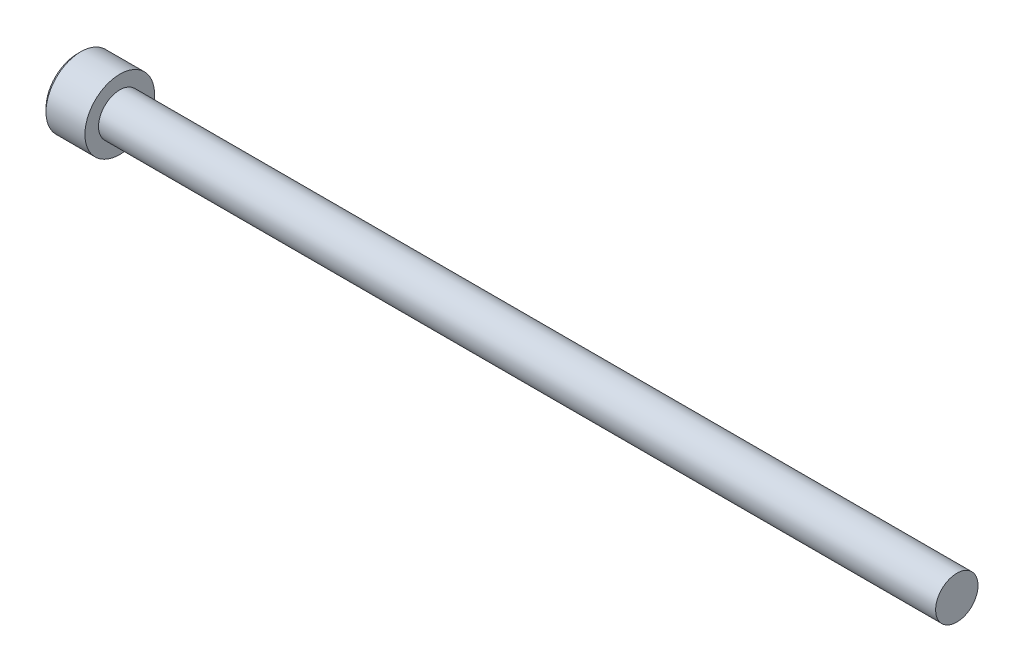
ISO-10303-21;
HEADER;
FILE_DESCRIPTION(('STEP AP214'),'2;1');
FILE_NAME('part.step','',(''),(''),'','','');
FILE_SCHEMA(('AUTOMOTIVE_DESIGN { 1 0 10303 214 1 1 1 1 }'));
ENDSEC;
DATA;
#1=APPLICATION_CONTEXT('core data for automotive mechanical design processes');
#2=APPLICATION_PROTOCOL_DEFINITION('international standard','automotive_design',2000,#1);
#3=PRODUCT_CONTEXT('',#1,'mechanical');
#4=PRODUCT('Part','Part','',(#3));
#5=PRODUCT_RELATED_PRODUCT_CATEGORY('part','',(#4));
#6=PRODUCT_DEFINITION_FORMATION('','',#4);
#7=PRODUCT_DEFINITION_CONTEXT('part definition',#1,'design');
#8=PRODUCT_DEFINITION('design','',#6,#7);
#9=PRODUCT_DEFINITION_SHAPE('','',#8);
#10=(LENGTH_UNIT() NAMED_UNIT(*) SI_UNIT(.MILLI.,.METRE.));
#11=(NAMED_UNIT(*) PLANE_ANGLE_UNIT() SI_UNIT($,.RADIAN.));
#12=(NAMED_UNIT(*) SI_UNIT($,.STERADIAN.) SOLID_ANGLE_UNIT());
#13=UNCERTAINTY_MEASURE_WITH_UNIT(LENGTH_MEASURE(1.E-05),#10,'distance_accuracy_value','');
#14=(GEOMETRIC_REPRESENTATION_CONTEXT(3) GLOBAL_UNCERTAINTY_ASSIGNED_CONTEXT((#13)) GLOBAL_UNIT_ASSIGNED_CONTEXT((#10,
#11,#12)) REPRESENTATION_CONTEXT('',''));
#15=CARTESIAN_POINT('',(0.,0.,0.));
#16=DIRECTION('',(0.,0.,1.));
#17=DIRECTION('',(1.,0.,0.));
#18=AXIS2_PLACEMENT_3D('',#15,#16,#17);
#19=CARTESIAN_POINT('',(-2.28600000000007,0.,0.));
#20=DIRECTION('',(-1.,0.,0.));
#21=DIRECTION('',(0.,0.,1.));
#22=AXIS2_PLACEMENT_3D('',#19,#20,#21);
#23=PLANE('',#22);
#24=DIRECTION('',(0.,0.5,0.866025403784439));
#25=VECTOR('',#24,1.);
#26=CARTESIAN_POINT('',(-2.28600000000007,2.29135888084633,0.));
#27=LINE('',#26,#25);
#28=CARTESIAN_POINT('',(-2.28600000000007,2.29135888084633,0.));
#29=VERTEX_POINT('',#28);
#30=CARTESIAN_POINT('',(-2.28600000000007,1.14567944042316,-1.984375));
#31=VERTEX_POINT('',#30);
#32=EDGE_CURVE('E72',#29,#31,#27,.F.);
#33=ORIENTED_EDGE('',*,*,#32,.T.);
#34=DIRECTION('',(0.,1.,0.));
#35=VECTOR('',#34,1.);
#36=CARTESIAN_POINT('',(-2.28600000000007,1.14567944042316,-1.984375));
#37=LINE('',#36,#35);
#38=CARTESIAN_POINT('',(-2.28600000000007,-1.14567944042316,-1.984375));
#39=VERTEX_POINT('',#38);
#40=EDGE_CURVE('E67',#31,#39,#37,.F.);
#41=ORIENTED_EDGE('',*,*,#40,.T.);
#42=DIRECTION('',(0.,0.5,-0.866025403784439));
#43=VECTOR('',#42,1.);
#44=CARTESIAN_POINT('',(-2.28600000000007,-1.14567944042316,-1.984375));
#45=LINE('',#44,#43);
#46=CARTESIAN_POINT('',(-2.28600000000007,-2.29135888084633,0.));
#47=VERTEX_POINT('',#46);
#48=EDGE_CURVE('E81',#39,#47,#45,.F.);
#49=ORIENTED_EDGE('',*,*,#48,.T.);
#50=DIRECTION('',(0.,-0.5,-0.866025403784439));
#51=VECTOR('',#50,1.);
#52=CARTESIAN_POINT('',(-2.28600000000007,-2.29135888084633,0.));
#53=LINE('',#52,#51);
#54=CARTESIAN_POINT('',(-2.28600000000007,-1.14567944042317,1.984375));
#55=VERTEX_POINT('',#54);
#56=EDGE_CURVE('E84',#47,#55,#53,.F.);
#57=ORIENTED_EDGE('',*,*,#56,.T.);
#58=DIRECTION('',(0.,1.,0.));
#59=VECTOR('',#58,1.);
#60=CARTESIAN_POINT('',(-2.28600000000007,-1.14567944042317,1.984375));
#61=LINE('',#60,#59);
#62=CARTESIAN_POINT('',(-2.28600000000007,1.14567944042317,1.984375));
#63=VERTEX_POINT('',#62);
#64=EDGE_CURVE('E94',#55,#63,#61,.T.);
#65=ORIENTED_EDGE('',*,*,#64,.T.);
#66=DIRECTION('',(0.,-0.5,0.866025403784439));
#67=VECTOR('',#66,1.);
#68=CARTESIAN_POINT('',(-2.28600000000007,1.14567944042316,1.984375));
#69=LINE('',#68,#67);
#70=EDGE_CURVE('E265',#63,#29,#69,.F.);
#71=ORIENTED_EDGE('',*,*,#70,.T.);
#72=EDGE_LOOP('',(#33,#41,#49,#57,#65,#71));
#73=FACE_BOUND('',#72,.T.);
#74=ADVANCED_FACE('F18',(#73),#23,.T.);
#75=CARTESIAN_POINT('',(-2.28600000000007,-1.14567944042316,-1.984375));
#76=DIRECTION('',(0.,-0.866025403784439,-0.5));
#77=DIRECTION('',(0.,0.5,-0.866025403784439));
#78=AXIS2_PLACEMENT_3D('',#75,#76,#77);
#79=PLANE('',#78);
#80=CARTESIAN_POINT('',(-4.82599999995871,-1.14567944040756,-1.98437500001887));
#81=CARTESIAN_POINT('',(-4.78666022792997,-1.18505700230148,-1.91617106214563));
#82=CARTESIAN_POINT('',(-4.74963132844072,-1.22509295783734,-1.8468267530301));
#83=CARTESIAN_POINT('',(-4.68183299424977,-1.30673037975396,-1.70542659047317));
#84=CARTESIAN_POINT('',(-4.65110127019237,-1.34833960561553,-1.63335729721673));
#85=CARTESIAN_POINT('',(-4.59845762010516,-1.432242568594,-1.48803310243203));
#86=CARTESIAN_POINT('',(-4.57641341195893,-1.47451494967301,-1.41481519064643));
#87=CARTESIAN_POINT('',(-4.54245011067441,-1.55999007976842,-1.26676792253773));
#88=CARTESIAN_POINT('',(-4.53050567471972,-1.6031902195197,-1.19194308559438));
#89=CARTESIAN_POINT('',(-4.51972842752365,-1.67764765054852,-1.06297903205139));
#90=CARTESIAN_POINT('',(-4.51813352794834,-1.70880881707173,-1.00900630841009));
#91=CARTESIAN_POINT('',(-4.52082392138599,-1.77108016542046,-0.901149169214274));
#92=CARTESIAN_POINT('',(-4.52511127545884,-1.80219032554946,-0.847264791239237));
#93=CARTESIAN_POINT('',(-4.53932219421538,-1.86411684097343,-0.740004920189235));
#94=CARTESIAN_POINT('',(-4.54925206045723,-1.8949328285454,-0.686630064029166));
#95=CARTESIAN_POINT('',(-4.5742029484467,-1.95603190279815,-0.580803363127978));
#96=CARTESIAN_POINT('',(-4.58922357974385,-1.98631503016081,-0.528351447923769));
#97=CARTESIAN_POINT('',(-4.63380478900425,-2.06386502548479,-0.394030915895904));
#98=CARTESIAN_POINT('',(-4.66672213384104,-2.11065153226583,-0.312994309042484));
#99=CARTESIAN_POINT('',(-4.72228952038986,-2.17944749410732,-0.193836207777459));
#100=CARTESIAN_POINT('',(-4.74181309375939,-2.20211890802843,-0.154568166986659));
#101=CARTESIAN_POINT('',(-4.78263970065987,-2.24704195201531,-0.0767591723707469));
#102=CARTESIAN_POINT('',(-4.80394164363173,-2.2692938292399,-0.0382177904539708));
#103=CARTESIAN_POINT('',(-4.82599999995675,-2.29135888085868,2.13931096265935E-11));
#104=B_SPLINE_CURVE_WITH_KNOTS('',3,(#80,#81,#82,#83,#84,#85,#86,#87,#88,#89,#90,#91,#92,#93,
#94,#95,#96,#97,#98,#99,#100,#101,#102,#103),.UNSPECIFIED.,.F.,.F.,(4,2,2,2,2,2,2,2,2,2,2,4),
(0.,0.264284909626495,0.530108996358094,0.791712695414128,1.05265800174404,1.23942150116703,
1.42625045663858,1.61328847394198,1.80031214908683,2.09727151182814,2.24534838946042,
2.39333511890876),.UNSPECIFIED.);
#105=CARTESIAN_POINT('',(-4.8259999999622,-1.14567944043207,-1.98437500001542));
#106=VERTEX_POINT('',#105);
#107=CARTESIAN_POINT('',(-4.82599999996846,-2.2913588808704,-2.00043543490866E-11));
#108=VERTEX_POINT('',#107);
#109=EDGE_CURVE('E21',#106,#108,#104,.T.);
#110=ORIENTED_EDGE('',*,*,#109,.T.);
#111=DIRECTION('',(1.,0.,0.));
#112=VECTOR('',#111,1.);
#113=CARTESIAN_POINT('',(-2.28600000000007,-2.29135888084633,0.));
#114=LINE('',#113,#112);
#115=EDGE_CURVE('E88',#108,#47,#114,.T.);
#116=ORIENTED_EDGE('',*,*,#115,.T.);
#117=ORIENTED_EDGE('',*,*,#48,.F.);
#118=DIRECTION('',(-1.,0.,0.));
#119=VECTOR('',#118,1.);
#120=CARTESIAN_POINT('',(-2.28600000000007,-1.14567944042316,-1.984375));
#121=LINE('',#120,#119);
#122=EDGE_CURVE('E59',#39,#106,#121,.T.);
#123=ORIENTED_EDGE('',*,*,#122,.T.);
#124=EDGE_LOOP('',(#110,#116,#117,#123));
#125=FACE_BOUND('',#124,.T.);
#126=ADVANCED_FACE('F89',(#125),#79,.F.);
#127=CARTESIAN_POINT('',(-2.28600000000007,-2.29135888084633,0.));
#128=DIRECTION('',(0.,-0.866025403784439,0.5));
#129=DIRECTION('',(0.,-0.5,-0.866025403784439));
#130=AXIS2_PLACEMENT_3D('',#127,#128,#129);
#131=PLANE('',#130);
#132=CARTESIAN_POINT('',(-4.8259999999587,-2.29135888085486,-2.29477011545215E-11));
#133=CARTESIAN_POINT('',(-4.78666022792997,-2.25198131896546,0.0682039378529055));
#134=CARTESIAN_POINT('',(-4.74963132844072,-2.21194536343147,0.137548246969503));
#135=CARTESIAN_POINT('',(-4.68183299424977,-2.13030794151622,0.278948409527231));
#136=CARTESIAN_POINT('',(-4.65110127019237,-2.08869871565414,0.351017702783381));
#137=CARTESIAN_POINT('',(-4.59845762010516,-2.00479575267531,0.49634189756787));
#138=CARTESIAN_POINT('',(-4.57641341195893,-1.96252337159644,0.569559809353542));
#139=CARTESIAN_POINT('',(-4.5424501106744,-1.87704824150112,0.717607077462301));
#140=CARTESIAN_POINT('',(-4.53050567471972,-1.8338481017498,0.792431914405622));
#141=CARTESIAN_POINT('',(-4.51972842752365,-1.75939067072096,0.921395967948603));
#142=CARTESIAN_POINT('',(-4.51813352794834,-1.72822950419776,0.975368691589913));
#143=CARTESIAN_POINT('',(-4.52082392138599,-1.66595815584903,1.08322583078573));
#144=CARTESIAN_POINT('',(-4.52511127545884,-1.63484799572003,1.13711020876076));
#145=CARTESIAN_POINT('',(-4.53932219421538,-1.57292148029607,1.24437007981077));
#146=CARTESIAN_POINT('',(-4.54925206045723,-1.54210549272409,1.29774493597083));
#147=CARTESIAN_POINT('',(-4.5742029484467,-1.48100641847134,1.40357163687202));
#148=CARTESIAN_POINT('',(-4.58922357974385,-1.45072329110868,1.45602355207623));
#149=CARTESIAN_POINT('',(-4.63380478900425,-1.3731732957847,1.5903440841041));
#150=CARTESIAN_POINT('',(-4.66672213384104,-1.32638678900366,1.67138069095752));
#151=CARTESIAN_POINT('',(-4.72228952038986,-1.25759082716218,1.79053879222254));
#152=CARTESIAN_POINT('',(-4.74181309375939,-1.23491941324106,1.82980683301334));
#153=CARTESIAN_POINT('',(-4.78263970065987,-1.18999636925419,1.90761582762925));
#154=CARTESIAN_POINT('',(-4.80394164363173,-1.1677444920296,1.94615720954603));
#155=CARTESIAN_POINT('',(-4.82599999995675,-1.14567944041081,1.98437500002139));
#156=B_SPLINE_CURVE_WITH_KNOTS('',3,(#132,#133,#134,#135,#136,#137,#138,#139,#140,#141,#142,
#143,#144,#145,#146,#147,#148,#149,#150,#151,#152,#153,#154,#155),.UNSPECIFIED.,.F.,.F.,(4,2,2,
2,2,2,2,2,2,2,2,4),(0.,0.264284909626495,0.530108996358093,0.791712695414127,1.05265800174404,
1.23942150116703,1.42625045663858,1.61328847394198,1.80031214908683,2.09727151182814,
2.24534838946042,2.39333511890876),.UNSPECIFIED.);
#157=CARTESIAN_POINT('',(-4.82599999996846,-1.14567944045252,1.98437500001084));
#158=VERTEX_POINT('',#157);
#159=EDGE_CURVE('E193',#108,#158,#156,.T.);
#160=ORIENTED_EDGE('',*,*,#159,.T.);
#161=DIRECTION('',(1.,0.,0.));
#162=VECTOR('',#161,1.);
#163=CARTESIAN_POINT('',(-2.28600000000007,-1.14567944042317,1.984375));
#164=LINE('',#163,#162);
#165=EDGE_CURVE('E98',#158,#55,#164,.T.);
#166=ORIENTED_EDGE('',*,*,#165,.T.);
#167=ORIENTED_EDGE('',*,*,#56,.F.);
#168=ORIENTED_EDGE('',*,*,#115,.F.);
#169=EDGE_LOOP('',(#160,#166,#167,#168));
#170=FACE_BOUND('',#169,.T.);
#171=ADVANCED_FACE('F96',(#170),#131,.F.);
#172=CARTESIAN_POINT('',(-2.28600000000007,-1.14567944042317,1.984375));
#173=DIRECTION('',(0.,0.,1.));
#174=DIRECTION('',(1.,0.,0.));
#175=AXIS2_PLACEMENT_3D('',#172,#173,#174);
#176=PLANE('',#175);
#177=ORIENTED_EDGE('',*,*,#165,.F.);
#178=CARTESIAN_POINT('',(-4.8259999999587,-1.14567944044731,1.98437499999592));
#179=CARTESIAN_POINT('',(-4.78691618362759,-1.06743880343337,1.98437499999852));
#180=CARTESIAN_POINT('',(-4.7501144768492,-0.987898318961585,1.9843749999996));
#181=CARTESIAN_POINT('',(-4.68265620500543,-0.825677042029378,1.9843750000004));
#182=CARTESIAN_POINT('',(-4.65204056061158,-0.742979382529768,1.98437500000011));
#183=CARTESIAN_POINT('',(-4.59917392283072,-0.575193959556404,1.98437499999988));
#184=CARTESIAN_POINT('',(-4.57689462080734,-0.49011535911761,1.98437499999994));
#185=CARTESIAN_POINT('',(-4.54259467221838,-0.318093091130319,1.98437500000006));
#186=CARTESIAN_POINT('',(-4.53054230228845,-0.231156054976752,1.98437500000012));
#187=CARTESIAN_POINT('',(-4.52249110263748,-0.119918521510987,1.98437499999997));
#188=CARTESIAN_POINT('',(-4.5211894755748,-0.095946844304627,1.98437499999992));
#189=CARTESIAN_POINT('',(-4.51945182629809,-0.0479845644411721,1.98437500000008));
#190=CARTESIAN_POINT('',(-4.51901533386212,-0.0239939791589256,1.98437500000028));
#191=CARTESIAN_POINT('',(-4.51901809008374,0.0602201717457216,1.98437500000061));
#192=CARTESIAN_POINT('',(-4.52177452299895,0.120461721905418,1.98437500000017));
#193=CARTESIAN_POINT('',(-4.53263655124937,0.240474970989155,1.98437499999983));
#194=CARTESIAN_POINT('',(-4.5407458774972,0.300246312758386,1.98437499999994));
#195=CARTESIAN_POINT('',(-4.57259622946933,0.478763752804253,1.98437500000012));
#196=CARTESIAN_POINT('',(-4.60385422611701,0.596208828937716,1.98437500000003));
#197=CARTESIAN_POINT('',(-4.66780003592242,0.785921487441385,1.98437499999998));
#198=CARTESIAN_POINT('',(-4.69623457768568,0.859734609867161,1.98437499999999));
#199=CARTESIAN_POINT('',(-4.75786140400834,1.00456595519332,1.98437500000001));
#200=CARTESIAN_POINT('',(-4.79100779300387,1.07560356657162,1.98437500000002));
#201=CARTESIAN_POINT('',(-4.82599999995679,1.14567944044795,1.984375));
#202=B_SPLINE_CURVE_WITH_KNOTS('',3,(#178,#179,#180,#181,#182,#183,#184,#185,#186,#187,#188,
#189,#190,#191,#192,#193,#194,#195,#196,#197,#198,#199,#200,#201),.UNSPECIFIED.,.F.,.F.,(4,2,2,
2,2,2,2,2,2,2,2,4),(0.,0.262559005207489,0.526801735838257,0.790138824405868,1.05265603861851,
1.12466619182165,1.19663719499109,1.37727026726594,1.55802937209457,1.92104085090406,
2.15819130092386,2.39317265078733),.UNSPECIFIED.);
#203=CARTESIAN_POINT('',(-4.82599999996846,1.14567944041787,1.98437500003084));
#204=VERTEX_POINT('',#203);
#205=EDGE_CURVE('E174',#158,#204,#202,.T.);
#206=ORIENTED_EDGE('',*,*,#205,.T.);
#207=DIRECTION('',(1.,0.,0.));
#208=VECTOR('',#207,1.);
#209=CARTESIAN_POINT('',(-2.28600000000007,1.14567944042316,1.984375));
#210=LINE('',#209,#208);
#211=EDGE_CURVE('E262',#204,#63,#210,.T.);
#212=ORIENTED_EDGE('',*,*,#211,.T.);
#213=ORIENTED_EDGE('',*,*,#64,.F.);
#214=EDGE_LOOP('',(#177,#206,#212,#213));
#215=FACE_BOUND('',#214,.T.);
#216=ADVANCED_FACE('F183',(#215),#176,.F.);
#217=CARTESIAN_POINT('',(-2.28600000000007,1.14567944042316,1.984375));
#218=DIRECTION('',(0.,0.866025403784439,0.5));
#219=DIRECTION('',(0.,-0.5,0.866025403784439));
#220=AXIS2_PLACEMENT_3D('',#217,#218,#219);
#221=PLANE('',#220);
#222=CARTESIAN_POINT('',(-4.8259999999587,1.14567944040756,1.98437500001887));
#223=CARTESIAN_POINT('',(-4.78666022792997,1.18505700230148,1.91617106214563));
#224=CARTESIAN_POINT('',(-4.74963132844072,1.22509295783734,1.8468267530301));
#225=CARTESIAN_POINT('',(-4.68183299424977,1.30673037975396,1.70542659047317));
#226=CARTESIAN_POINT('',(-4.65110127019237,1.34833960561553,1.63335729721672));
#227=CARTESIAN_POINT('',(-4.59845762010516,1.432242568594,1.48803310243203));
#228=CARTESIAN_POINT('',(-4.57641341195893,1.47451494967301,1.41481519064643));
#229=CARTESIAN_POINT('',(-4.5424501106744,1.55999007976842,1.26676792253773));
#230=CARTESIAN_POINT('',(-4.53050567471972,1.6031902195197,1.19194308559439));
#231=CARTESIAN_POINT('',(-4.51972842752365,1.67764765054852,1.06297903205139));
#232=CARTESIAN_POINT('',(-4.51813352794834,1.70880881707173,1.00900630841009));
#233=CARTESIAN_POINT('',(-4.52082392138599,1.77108016542046,0.901149169214275));
#234=CARTESIAN_POINT('',(-4.52511127545884,1.80219032554946,0.847264791239238));
#235=CARTESIAN_POINT('',(-4.53932219421538,1.86411684097342,0.740004920189235));
#236=CARTESIAN_POINT('',(-4.54925206045723,1.8949328285454,0.686630064029167));
#237=CARTESIAN_POINT('',(-4.5742029484467,1.95603190279815,0.580803363127978));
#238=CARTESIAN_POINT('',(-4.58922357974385,1.98631503016081,0.52835144792377));
#239=CARTESIAN_POINT('',(-4.63380478900425,2.06386502548479,0.394030915895905));
#240=CARTESIAN_POINT('',(-4.66672213384104,2.11065153226583,0.312994309042484));
#241=CARTESIAN_POINT('',(-4.72228952038986,2.17944749410732,0.19383620777746));
#242=CARTESIAN_POINT('',(-4.74181309375939,2.20211890802843,0.154568166986659));
#243=CARTESIAN_POINT('',(-4.78263970065987,2.2470419520153,0.0767591723707469));
#244=CARTESIAN_POINT('',(-4.80394164363173,2.2692938292399,0.0382177904539711));
#245=CARTESIAN_POINT('',(-4.82599999995675,2.29135888085868,-2.13927120621134E-11));
#246=B_SPLINE_CURVE_WITH_KNOTS('',3,(#222,#223,#224,#225,#226,#227,#228,#229,#230,#231,#232,
#233,#234,#235,#236,#237,#238,#239,#240,#241,#242,#243,#244,#245),.UNSPECIFIED.,.F.,.F.,(4,2,2,
2,2,2,2,2,2,2,2,4),(0.,0.264284909626494,0.530108996358092,0.791712695414125,1.05265800174404,
1.23942150116703,1.42625045663858,1.61328847394198,1.80031214908683,2.09727151182813,
2.24534838946042,2.39333511890876),.UNSPECIFIED.);
#247=CARTESIAN_POINT('',(-4.82599999996846,2.29135888087039,2.00042200943634E-11));
#248=VERTEX_POINT('',#247);
#249=EDGE_CURVE('E168',#204,#248,#246,.T.);
#250=ORIENTED_EDGE('',*,*,#249,.T.);
#251=DIRECTION('',(1.,0.,0.));
#252=VECTOR('',#251,1.);
#253=CARTESIAN_POINT('',(-2.28600000000007,2.29135888084633,0.));
#254=LINE('',#253,#252);
#255=EDGE_CURVE('E257',#248,#29,#254,.T.);
#256=ORIENTED_EDGE('',*,*,#255,.T.);
#257=ORIENTED_EDGE('',*,*,#70,.F.);
#258=ORIENTED_EDGE('',*,*,#211,.F.);
#259=EDGE_LOOP('',(#250,#256,#257,#258));
#260=FACE_BOUND('',#259,.T.);
#261=ADVANCED_FACE('F179',(#260),#221,.F.);
#262=CARTESIAN_POINT('',(-2.28600000000007,2.29135888084633,0.));
#263=DIRECTION('',(0.,0.866025403784439,-0.5));
#264=DIRECTION('',(0.,0.5,0.866025403784439));
#265=AXIS2_PLACEMENT_3D('',#262,#263,#264);
#266=PLANE('',#265);
#267=CARTESIAN_POINT('',(-4.82599999995871,2.29135888085486,2.29489280696874E-11));
#268=CARTESIAN_POINT('',(-4.78666022792997,2.25198131896547,-0.0682039378529039));
#269=CARTESIAN_POINT('',(-4.74963132844072,2.21194536343147,-0.137548246969502));
#270=CARTESIAN_POINT('',(-4.68183299424977,2.13030794151622,-0.278948409527229));
#271=CARTESIAN_POINT('',(-4.65110127019237,2.08869871565414,-0.351017702783379));
#272=CARTESIAN_POINT('',(-4.59845762010516,2.00479575267531,-0.496341897567869));
#273=CARTESIAN_POINT('',(-4.57641341195893,1.96252337159644,-0.569559809353541));
#274=CARTESIAN_POINT('',(-4.5424501106744,1.87704824150112,-0.7176070774623));
#275=CARTESIAN_POINT('',(-4.53050567471972,1.8338481017498,-0.792431914405622));
#276=CARTESIAN_POINT('',(-4.51972842752365,1.75939067072096,-0.921395967948603));
#277=CARTESIAN_POINT('',(-4.51813352794834,1.72822950419776,-0.975368691589912));
#278=CARTESIAN_POINT('',(-4.52082392138599,1.66595815584903,-1.08322583078573));
#279=CARTESIAN_POINT('',(-4.52511127545884,1.63484799572003,-1.13711020876076));
#280=CARTESIAN_POINT('',(-4.53932219421538,1.57292148029607,-1.24437007981077));
#281=CARTESIAN_POINT('',(-4.54925206045723,1.54210549272409,-1.29774493597083));
#282=CARTESIAN_POINT('',(-4.5742029484467,1.48100641847134,-1.40357163687202));
#283=CARTESIAN_POINT('',(-4.58922357974385,1.45072329110868,-1.45602355207623));
#284=CARTESIAN_POINT('',(-4.63380478900425,1.3731732957847,-1.5903440841041));
#285=CARTESIAN_POINT('',(-4.66672213384104,1.32638678900366,-1.67138069095752));
#286=CARTESIAN_POINT('',(-4.72228952038986,1.25759082716218,-1.79053879222254));
#287=CARTESIAN_POINT('',(-4.74181309375939,1.23491941324106,-1.82980683301334));
#288=CARTESIAN_POINT('',(-4.78263970065987,1.18999636925419,-1.90761582762925));
#289=CARTESIAN_POINT('',(-4.80394164363173,1.1677444920296,-1.94615720954603));
#290=CARTESIAN_POINT('',(-4.82599999995675,1.14567944041081,-1.98437500002139));
#291=B_SPLINE_CURVE_WITH_KNOTS('',3,(#267,#268,#269,#270,#271,#272,#273,#274,#275,#276,#277,
#278,#279,#280,#281,#282,#283,#284,#285,#286,#287,#288,#289,#290),.UNSPECIFIED.,.F.,.F.,(4,2,2,
2,2,2,2,2,2,2,2,4),(0.,0.264284909626495,0.530108996358093,0.791712695414127,1.05265800174404,
1.23942150116703,1.42625045663858,1.61328847394198,1.80031214908683,2.09727151182814,
2.24534838946042,2.39333511890876),.UNSPECIFIED.);
#292=CARTESIAN_POINT('',(-4.82599999996846,1.14567944045252,-1.98437500001084));
#293=VERTEX_POINT('',#292);
#294=EDGE_CURVE('E40',#248,#293,#291,.T.);
#295=ORIENTED_EDGE('',*,*,#294,.T.);
#296=DIRECTION('',(-1.,0.,0.));
#297=VECTOR('',#296,1.);
#298=CARTESIAN_POINT('',(-2.28600000000007,1.14567944042316,-1.984375));
#299=LINE('',#298,#297);
#300=EDGE_CURVE('E247',#293,#31,#299,.F.);
#301=ORIENTED_EDGE('',*,*,#300,.T.);
#302=ORIENTED_EDGE('',*,*,#32,.F.);
#303=ORIENTED_EDGE('',*,*,#255,.F.);
#304=EDGE_LOOP('',(#295,#301,#302,#303));
#305=FACE_BOUND('',#304,.T.);
#306=ADVANCED_FACE('F182',(#305),#266,.F.);
#307=CARTESIAN_POINT('',(-2.28600000000007,1.14567944042316,-1.984375));
#308=DIRECTION('',(0.,0.,-1.));
#309=DIRECTION('',(-1.,0.,0.));
#310=AXIS2_PLACEMENT_3D('',#307,#308,#309);
#311=PLANE('',#310);
#312=CARTESIAN_POINT('',(-4.8259999999587,1.14567944044731,-1.98437499999592));
#313=CARTESIAN_POINT('',(-4.78666022793094,1.06692431665146,-1.98437499999853));
#314=CARTESIAN_POINT('',(-4.74963132844318,0.986852405569011,-1.98437499999961));
#315=CARTESIAN_POINT('',(-4.6818329942566,0.823577561711963,-1.9843750000004));
#316=CARTESIAN_POINT('',(-4.65110127020207,0.740359109975722,-1.98437500000011));
#317=CARTESIAN_POINT('',(-4.59845762012233,0.572553183993917,-1.9843749999999));
#318=CARTESIAN_POINT('',(-4.57641341198063,0.488008421824127,-1.98437499999997));
#319=CARTESIAN_POINT('',(-4.54245011070673,0.317058161610178,-1.98437500000003));
#320=CARTESIAN_POINT('',(-4.53050567475816,0.230657882096267,-1.98437500000001));
#321=CARTESIAN_POINT('',(-4.51972842757294,0.0817430200124032,-1.984375));
#322=CARTESIAN_POINT('',(-4.51813352800283,0.0194206869508218,-1.984375));
#323=CARTESIAN_POINT('',(-4.52082392145254,-0.1051220097764,-1.984375));
#324=CARTESIAN_POINT('',(-4.52511127553227,-0.167342330049008,-1.984375));
#325=CARTESIAN_POINT('',(-4.53932219430377,-0.291195360925477,-1.984375));
#326=CARTESIAN_POINT('',(-4.54925206055372,-0.352827336083362,-1.984375));
#327=CARTESIAN_POINT('',(-4.57420294856008,-0.475025484616114,-1.984375));
#328=CARTESIAN_POINT('',(-4.58922357986604,-0.535591739354747,-1.984375));
#329=CARTESIAN_POINT('',(-4.63380478912724,-0.690691729958653,-1.984375));
#330=CARTESIAN_POINT('',(-4.66672213394715,-0.784264743465576,-1.984375));
#331=CARTESIAN_POINT('',(-4.7222895204619,-0.921856667069616,-1.984375));
#332=CARTESIAN_POINT('',(-4.74181309381856,-0.967199494886089,-1.984375));
#333=CARTESIAN_POINT('',(-4.78263970069104,-1.05704558280959,-1.984375));
#334=CARTESIAN_POINT('',(-4.80394164364776,-1.10154933723428,-1.984375));
#335=CARTESIAN_POINT('',(-4.82599999995675,-1.14567944044787,-1.984375));
#336=B_SPLINE_CURVE_WITH_KNOTS('',3,(#312,#313,#314,#315,#316,#317,#318,#319,#320,#321,#322,
#323,#324,#325,#326,#327,#328,#329,#330,#331,#332,#333,#334,#335),.UNSPECIFIED.,.F.,.F.,(4,2,2,
2,2,2,2,2,2,2,2,4),(0.,0.264284909658836,0.530108996422784,0.791712695509868,1.0526580018708,
1.23942150133878,1.42625045685537,1.61328847420389,1.80031214939384,2.09727151196384,
2.24534838950992,2.39333511887245),.UNSPECIFIED.);
#337=EDGE_CURVE('E133',#293,#106,#336,.T.);
#338=ORIENTED_EDGE('',*,*,#337,.T.);
#339=ORIENTED_EDGE('',*,*,#122,.F.);
#340=ORIENTED_EDGE('',*,*,#40,.F.);
#341=ORIENTED_EDGE('',*,*,#300,.F.);
#342=EDGE_LOOP('',(#338,#339,#340,#341));
#343=FACE_BOUND('',#342,.T.);
#344=ADVANCED_FACE('F146',(#343),#311,.F.);
#345=CARTESIAN_POINT('',(-4.82599999998001,0.,0.));
#346=DIRECTION('',(-1.,0.,0.));
#347=DIRECTION('',(0.,0.,1.));
#348=AXIS2_PLACEMENT_3D('',#345,#346,#347);
#349=CONICAL_SURFACE('',#348,2.29135888088194,0.785398163397448);
#350=ORIENTED_EDGE('',*,*,#109,.F.);
#351=CARTESIAN_POINT('',(-4.82599999998001,0.,0.));
#352=DIRECTION('',(-1.,0.,0.));
#353=DIRECTION('',(0.,0.,1.));
#354=AXIS2_PLACEMENT_3D('',#351,#352,#353);
#355=CIRCLE('',#354,2.29135888088194);
#356=EDGE_CURVE('E131',#106,#108,#355,.T.);
#357=ORIENTED_EDGE('',*,*,#356,.T.);
#358=EDGE_LOOP('',(#350,#357));
#359=FACE_BOUND('',#358,.T.);
#360=ADVANCED_FACE('F200',(#359),#349,.F.);
#361=CARTESIAN_POINT('',(-4.82599999998001,0.,0.));
#362=DIRECTION('',(-1.,0.,0.));
#363=DIRECTION('',(0.,0.,1.));
#364=AXIS2_PLACEMENT_3D('',#361,#362,#363);
#365=CONICAL_SURFACE('',#364,2.29135888088194,0.785398163397448);
#366=ORIENTED_EDGE('',*,*,#159,.F.);
#367=CARTESIAN_POINT('',(-4.82599999998001,0.,0.));
#368=DIRECTION('',(-1.,0.,0.));
#369=DIRECTION('',(0.,0.,1.));
#370=AXIS2_PLACEMENT_3D('',#367,#368,#369);
#371=CIRCLE('',#370,2.29135888088194);
#372=EDGE_CURVE('E128',#108,#158,#371,.T.);
#373=ORIENTED_EDGE('',*,*,#372,.T.);
#374=EDGE_LOOP('',(#366,#373));
#375=FACE_BOUND('',#374,.T.);
#376=ADVANCED_FACE('F197',(#375),#365,.F.);
#377=CARTESIAN_POINT('',(-4.82599999998001,0.,0.));
#378=DIRECTION('',(-1.,0.,0.));
#379=DIRECTION('',(0.,0.,1.));
#380=AXIS2_PLACEMENT_3D('',#377,#378,#379);
#381=CONICAL_SURFACE('',#380,2.29135888088194,0.78539816348948);
#382=ORIENTED_EDGE('',*,*,#205,.F.);
#383=CARTESIAN_POINT('',(-4.82599999998001,0.,0.));
#384=DIRECTION('',(-1.,0.,0.));
#385=DIRECTION('',(0.,0.,1.));
#386=AXIS2_PLACEMENT_3D('',#383,#384,#385);
#387=CIRCLE('',#386,2.29135888088194);
#388=EDGE_CURVE('E125',#158,#204,#387,.T.);
#389=ORIENTED_EDGE('',*,*,#388,.T.);
#390=EDGE_LOOP('',(#382,#389));
#391=FACE_BOUND('',#390,.T.);
#392=ADVANCED_FACE('F164',(#391),#381,.F.);
#393=CARTESIAN_POINT('',(-4.82599999998001,0.,0.));
#394=DIRECTION('',(-1.,0.,0.));
#395=DIRECTION('',(0.,0.,1.));
#396=AXIS2_PLACEMENT_3D('',#393,#394,#395);
#397=CONICAL_SURFACE('',#396,2.29135888088194,0.785398163397448);
#398=ORIENTED_EDGE('',*,*,#249,.F.);
#399=CARTESIAN_POINT('',(-4.82599999998001,0.,0.));
#400=DIRECTION('',(-1.,0.,0.));
#401=DIRECTION('',(0.,0.,1.));
#402=AXIS2_PLACEMENT_3D('',#399,#400,#401);
#403=CIRCLE('',#402,2.29135888088194);
#404=EDGE_CURVE('E122',#204,#248,#403,.T.);
#405=ORIENTED_EDGE('',*,*,#404,.T.);
#406=EDGE_LOOP('',(#398,#405));
#407=FACE_BOUND('',#406,.T.);
#408=ADVANCED_FACE('F159',(#407),#397,.F.);
#409=CARTESIAN_POINT('',(-4.82599999998001,0.,0.));
#410=DIRECTION('',(-1.,0.,0.));
#411=DIRECTION('',(0.,0.,1.));
#412=AXIS2_PLACEMENT_3D('',#409,#410,#411);
#413=CONICAL_SURFACE('',#412,2.29135888088194,0.785398163397448);
#414=ORIENTED_EDGE('',*,*,#294,.F.);
#415=CARTESIAN_POINT('',(-4.82599999998001,0.,0.));
#416=DIRECTION('',(-1.,0.,0.));
#417=DIRECTION('',(0.,0.,1.));
#418=AXIS2_PLACEMENT_3D('',#415,#416,#417);
#419=CIRCLE('',#418,2.29135888088194);
#420=EDGE_CURVE('E119',#248,#293,#419,.T.);
#421=ORIENTED_EDGE('',*,*,#420,.T.);
#422=EDGE_LOOP('',(#414,#421));
#423=FACE_BOUND('',#422,.T.);
#424=ADVANCED_FACE('F153',(#423),#413,.F.);
#425=CARTESIAN_POINT('',(-4.82599999998001,0.,0.));
#426=DIRECTION('',(-1.,0.,0.));
#427=DIRECTION('',(0.,0.,1.));
#428=AXIS2_PLACEMENT_3D('',#425,#426,#427);
#429=CONICAL_SURFACE('',#428,2.29135888088194,0.785398163489476);
#430=ORIENTED_EDGE('',*,*,#337,.F.);
#431=CARTESIAN_POINT('',(-4.82599999998001,0.,0.));
#432=DIRECTION('',(-1.,0.,0.));
#433=DIRECTION('',(0.,0.,1.));
#434=AXIS2_PLACEMENT_3D('',#431,#432,#433);
#435=CIRCLE('',#434,2.29135888088194);
#436=EDGE_CURVE('E116',#293,#106,#435,.T.);
#437=ORIENTED_EDGE('',*,*,#436,.T.);
#438=EDGE_LOOP('',(#430,#437));
#439=FACE_BOUND('',#438,.T.);
#440=ADVANCED_FACE('F148',(#439),#429,.F.);
#441=CARTESIAN_POINT('',(-4.82600000000007,0.,0.));
#442=DIRECTION('',(1.,0.,0.));
#443=DIRECTION('',(0.,0.,-1.));
#444=AXIS2_PLACEMENT_3D('',#441,#442,#443);
#445=PLANE('',#444);
#446=CARTESIAN_POINT('',(-4.82599999998001,0.,0.));
#447=DIRECTION('',(1.,0.,0.));
#448=DIRECTION('',(0.,0.,-1.));
#449=AXIS2_PLACEMENT_3D('',#446,#447,#448);
#450=CIRCLE('',#449,3.56615999999121);
#451=CARTESIAN_POINT('',(-4.82599999998001,0.,-3.56615999999121));
#452=VERTEX_POINT('',#451);
#453=EDGE_CURVE('E113',#452,#452,#450,.T.);
#454=ORIENTED_EDGE('',*,*,#453,.F.);
#455=EDGE_LOOP('',(#454));
#456=FACE_BOUND('',#455,.T.);
#457=ORIENTED_EDGE('',*,*,#420,.F.);
#458=ORIENTED_EDGE('',*,*,#404,.F.);
#459=ORIENTED_EDGE('',*,*,#388,.F.);
#460=ORIENTED_EDGE('',*,*,#372,.F.);
#461=ORIENTED_EDGE('',*,*,#356,.F.);
#462=ORIENTED_EDGE('',*,*,#436,.F.);
#463=EDGE_LOOP('',(#457,#458,#459,#460,#461,#462));
#464=FACE_BOUND('',#463,.T.);
#465=ADVANCED_FACE('F152',(#456,#464),#445,.F.);
#466=CARTESIAN_POINT('',(-4.42976000010731,0.,0.));
#467=DIRECTION('',(1.,0.,0.));
#468=DIRECTION('',(0.,0.,-1.));
#469=AXIS2_PLACEMENT_3D('',#466,#467,#468);
#470=CONICAL_SURFACE('',#469,3.96239999986392,0.785398163397448);
#471=CARTESIAN_POINT('',(-4.42976000000007,0.,0.));
#472=DIRECTION('',(-1.,0.,0.));
#473=DIRECTION('',(0.,0.,1.));
#474=AXIS2_PLACEMENT_3D('',#471,#472,#473);
#475=CIRCLE('',#474,3.9624);
#476=CARTESIAN_POINT('',(-4.42976000000007,0.,3.9624));
#477=VERTEX_POINT('',#476);
#478=EDGE_CURVE('E112',#477,#477,#475,.F.);
#479=ORIENTED_EDGE('',*,*,#478,.F.);
#480=EDGE_LOOP('',(#479));
#481=FACE_BOUND('',#480,.T.);
#482=ORIENTED_EDGE('',*,*,#453,.T.);
#483=EDGE_LOOP('',(#482));
#484=FACE_BOUND('',#483,.T.);
#485=ADVANCED_FACE('F228',(#481,#484),#470,.T.);
#486=CARTESIAN_POINT('',(-4.82600000000008,0.,0.));
#487=DIRECTION('',(-1.,0.,0.));
#488=DIRECTION('',(0.,0.,1.));
#489=AXIS2_PLACEMENT_3D('',#486,#487,#488);
#490=CYLINDRICAL_SURFACE('',#489,3.9624);
#491=ORIENTED_EDGE('',*,*,#478,.T.);
#492=EDGE_LOOP('',(#491));
#493=FACE_BOUND('',#492,.T.);
#494=CARTESIAN_POINT('',(0.,0.,0.));
#495=DIRECTION('',(-1.,0.,0.));
#496=DIRECTION('',(0.,0.,1.));
#497=AXIS2_PLACEMENT_3D('',#494,#495,#496);
#498=CIRCLE('',#497,3.9624);
#499=CARTESIAN_POINT('',(0.,0.,3.9624));
#500=VERTEX_POINT('',#499);
#501=EDGE_CURVE('E109',#500,#500,#498,.T.);
#502=ORIENTED_EDGE('',*,*,#501,.T.);
#503=EDGE_LOOP('',(#502));
#504=FACE_BOUND('',#503,.T.);
#505=ADVANCED_FACE('F225',(#493,#504),#490,.T.);
#506=CARTESIAN_POINT('',(95.25,0.,0.));
#507=DIRECTION('',(1.,0.,0.));
#508=DIRECTION('',(0.,0.,-1.));
#509=AXIS2_PLACEMENT_3D('',#506,#507,#508);
#510=PLANE('',#509);
#511=CARTESIAN_POINT('',(95.25,0.,0.));
#512=DIRECTION('',(-1.,0.,0.));
#513=DIRECTION('',(0.,0.,1.));
#514=AXIS2_PLACEMENT_3D('',#511,#512,#513);
#515=CIRCLE('',#514,2.413);
#516=CARTESIAN_POINT('',(95.25,0.,2.413));
#517=VERTEX_POINT('',#516);
#518=EDGE_CURVE('E31',#517,#517,#515,.T.);
#519=ORIENTED_EDGE('',*,*,#518,.F.);
#520=EDGE_LOOP('',(#519));
#521=FACE_BOUND('',#520,.T.);
#522=ADVANCED_FACE('F218',(#521),#510,.T.);
#523=CARTESIAN_POINT('',(0.,3.9624,0.));
#524=DIRECTION('',(-1.,0.,0.));
#525=DIRECTION('',(0.,0.,1.));
#526=AXIS2_PLACEMENT_3D('',#523,#524,#525);
#527=PLANE('',#526);
#528=CARTESIAN_POINT('',(0.,0.,0.));
#529=DIRECTION('',(-1.,0.,0.));
#530=DIRECTION('',(0.,0.,1.));
#531=AXIS2_PLACEMENT_3D('',#528,#529,#530);
#532=CIRCLE('',#531,2.413);
#533=CARTESIAN_POINT('',(0.,0.,2.413));
#534=VERTEX_POINT('',#533);
#535=EDGE_CURVE('E11',#534,#534,#532,.F.);
#536=ORIENTED_EDGE('',*,*,#535,.F.);
#537=EDGE_LOOP('',(#536));
#538=FACE_BOUND('',#537,.T.);
#539=ORIENTED_EDGE('',*,*,#501,.F.);
#540=EDGE_LOOP('',(#539));
#541=FACE_BOUND('',#540,.T.);
#542=ADVANCED_FACE('F212',(#538,#541),#527,.F.);
#543=CARTESIAN_POINT('',(95.25,0.,0.));
#544=DIRECTION('',(-1.,0.,0.));
#545=DIRECTION('',(0.,0.,1.));
#546=AXIS2_PLACEMENT_3D('',#543,#544,#545);
#547=CYLINDRICAL_SURFACE('',#546,2.413);
#548=ORIENTED_EDGE('',*,*,#535,.T.);
#549=EDGE_LOOP('',(#548));
#550=FACE_BOUND('',#549,.T.);
#551=ORIENTED_EDGE('',*,*,#518,.T.);
#552=EDGE_LOOP('',(#551));
#553=FACE_BOUND('',#552,.T.);
#554=ADVANCED_FACE('F210',(#550,#553),#547,.T.);
#555=CLOSED_SHELL('',(#74,#126,#171,#216,#261,#306,#344,#360,#376,#392,#408,#424,#440,#465,#485,
#505,#522,#542,#554));
#556=MANIFOLD_SOLID_BREP('B1',#555);
#557=ADVANCED_BREP_SHAPE_REPRESENTATION('',(#18,#556),#14);
#558=SHAPE_DEFINITION_REPRESENTATION(#9,#557);
ENDSEC;
END-ISO-10303-21;
